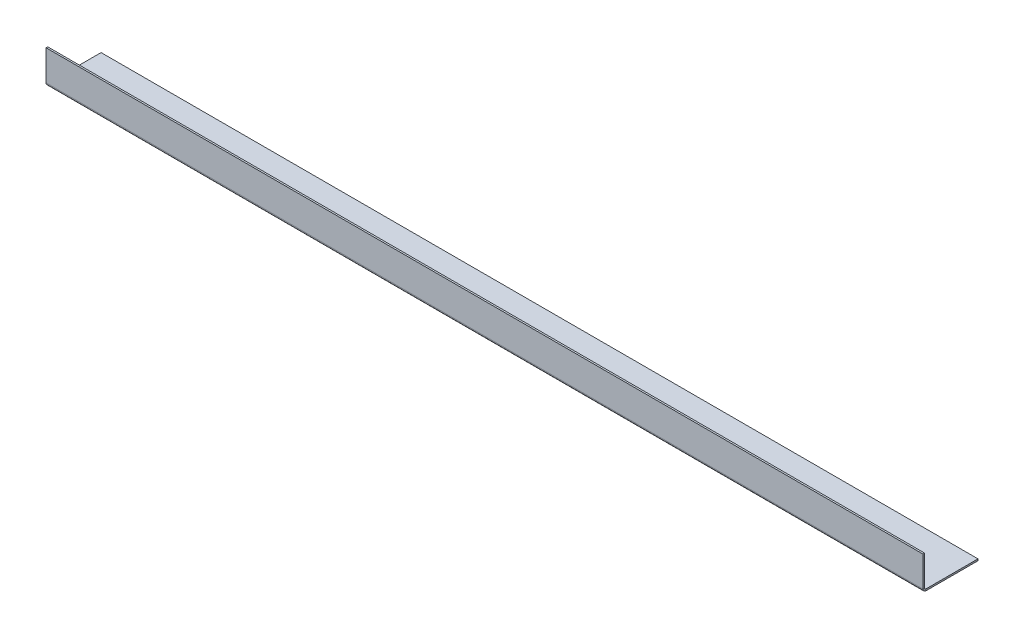
ISO-10303-21;
HEADER;
FILE_DESCRIPTION(('STEP AP214'),'2;1');
FILE_NAME('part.step','',(''),(''),'','','');
FILE_SCHEMA(('AUTOMOTIVE_DESIGN { 1 0 10303 214 1 1 1 1 }'));
ENDSEC;
DATA;
#1=APPLICATION_CONTEXT('core data for automotive mechanical design processes');
#2=APPLICATION_PROTOCOL_DEFINITION('international standard','automotive_design',2000,#1);
#3=PRODUCT_CONTEXT('',#1,'mechanical');
#4=PRODUCT('Part','Part','',(#3));
#5=PRODUCT_RELATED_PRODUCT_CATEGORY('part','',(#4));
#6=PRODUCT_DEFINITION_FORMATION('','',#4);
#7=PRODUCT_DEFINITION_CONTEXT('part definition',#1,'design');
#8=PRODUCT_DEFINITION('design','',#6,#7);
#9=PRODUCT_DEFINITION_SHAPE('','',#8);
#10=(LENGTH_UNIT() NAMED_UNIT(*) SI_UNIT(.MILLI.,.METRE.));
#11=(NAMED_UNIT(*) PLANE_ANGLE_UNIT() SI_UNIT($,.RADIAN.));
#12=(NAMED_UNIT(*) SI_UNIT($,.STERADIAN.) SOLID_ANGLE_UNIT());
#13=UNCERTAINTY_MEASURE_WITH_UNIT(LENGTH_MEASURE(1.E-05),#10,'distance_accuracy_value','');
#14=(GEOMETRIC_REPRESENTATION_CONTEXT(3) GLOBAL_UNCERTAINTY_ASSIGNED_CONTEXT((#13)) GLOBAL_UNIT_ASSIGNED_CONTEXT((#10,
#11,#12)) REPRESENTATION_CONTEXT('',''));
#15=CARTESIAN_POINT('',(0.,0.,0.));
#16=DIRECTION('',(0.,0.,1.));
#17=DIRECTION('',(1.,0.,0.));
#18=AXIS2_PLACEMENT_3D('',#15,#16,#17);
#19=CARTESIAN_POINT('',(0.,3.,93.5));
#20=DIRECTION('',(0.,-1.,0.));
#21=DIRECTION('',(1.,0.,0.));
#22=AXIS2_PLACEMENT_3D('',#19,#20,#21);
#23=PLANE('',#22);
#24=DIRECTION('',(-1.,0.,0.));
#25=VECTOR('',#24,1.);
#26=CARTESIAN_POINT('',(0.,3.,0.));
#27=LINE('',#26,#25);
#28=CARTESIAN_POINT('',(0.,3.,0.));
#29=VERTEX_POINT('',#28);
#30=CARTESIAN_POINT('',(-1576.,2.99999999999981,0.));
#31=VERTEX_POINT('',#30);
#32=EDGE_CURVE('E116',#29,#31,#27,.T.);
#33=ORIENTED_EDGE('',*,*,#32,.T.);
#34=DIRECTION('',(0.,0.,-1.));
#35=VECTOR('',#34,1.);
#36=CARTESIAN_POINT('',(-1576.,2.99999999999981,93.5));
#37=LINE('',#36,#35);
#38=CARTESIAN_POINT('',(-1576.,2.99999999999989,93.5));
#39=VERTEX_POINT('',#38);
#40=EDGE_CURVE('E13',#39,#31,#37,.T.);
#41=ORIENTED_EDGE('',*,*,#40,.F.);
#42=DIRECTION('',(-1.,0.,0.));
#43=VECTOR('',#42,1.);
#44=CARTESIAN_POINT('',(0.,3.,93.5));
#45=LINE('',#44,#43);
#46=CARTESIAN_POINT('',(0.,2.99999999999989,93.5));
#47=VERTEX_POINT('',#46);
#48=EDGE_CURVE('E117',#47,#39,#45,.T.);
#49=ORIENTED_EDGE('',*,*,#48,.F.);
#50=DIRECTION('',(0.,0.,-1.));
#51=VECTOR('',#50,1.);
#52=CARTESIAN_POINT('',(0.,3.,93.5));
#53=LINE('',#52,#51);
#54=EDGE_CURVE('E102',#47,#29,#53,.T.);
#55=ORIENTED_EDGE('',*,*,#54,.T.);
#56=EDGE_LOOP('',(#33,#41,#49,#55));
#57=FACE_BOUND('',#56,.T.);
#58=ADVANCED_FACE('F59',(#57),#23,.F.);
#59=CARTESIAN_POINT('',(-1576.,-1.93004335545623E-13,93.5));
#60=DIRECTION('',(-1.,0.,0.));
#61=DIRECTION('',(0.,0.,1.));
#62=AXIS2_PLACEMENT_3D('',#59,#60,#61);
#63=PLANE('',#62);
#64=DIRECTION('',(0.,1.,0.));
#65=VECTOR('',#64,1.);
#66=CARTESIAN_POINT('',(-1576.,-1.93004335545623E-13,0.));
#67=LINE('',#66,#65);
#68=CARTESIAN_POINT('',(-1576.,-1.93004335545623E-13,0.));
#69=VERTEX_POINT('',#68);
#70=EDGE_CURVE('E111',#69,#31,#67,.T.);
#71=ORIENTED_EDGE('',*,*,#70,.F.);
#72=DIRECTION('',(0.,0.,-1.));
#73=VECTOR('',#72,1.);
#74=CARTESIAN_POINT('',(-1576.,-1.93004335545623E-13,93.5));
#75=LINE('',#74,#73);
#76=CARTESIAN_POINT('',(-1576.,-1.93004335545623E-13,93.5));
#77=VERTEX_POINT('',#76);
#78=EDGE_CURVE('E67',#77,#69,#75,.T.);
#79=ORIENTED_EDGE('',*,*,#78,.F.);
#80=DIRECTION('',(0.,1.,0.));
#81=VECTOR('',#80,1.);
#82=CARTESIAN_POINT('',(-1576.,-1.93004335545623E-13,93.5));
#83=LINE('',#82,#81);
#84=EDGE_CURVE('E120',#77,#39,#83,.T.);
#85=ORIENTED_EDGE('',*,*,#84,.T.);
#86=ORIENTED_EDGE('',*,*,#40,.T.);
#87=EDGE_LOOP('',(#71,#79,#85,#86));
#88=FACE_BOUND('',#87,.T.);
#89=ADVANCED_FACE('F132',(#88),#63,.T.);
#90=CARTESIAN_POINT('',(0.,0.,93.5));
#91=DIRECTION('',(0.,-1.,0.));
#92=DIRECTION('',(1.,0.,0.));
#93=AXIS2_PLACEMENT_3D('',#90,#91,#92);
#94=PLANE('',#93);
#95=DIRECTION('',(-1.,0.,0.));
#96=VECTOR('',#95,1.);
#97=CARTESIAN_POINT('',(0.,0.,0.));
#98=LINE('',#97,#96);
#99=CARTESIAN_POINT('',(0.,0.,0.));
#100=VERTEX_POINT('',#99);
#101=EDGE_CURVE('E105',#100,#69,#98,.T.);
#102=ORIENTED_EDGE('',*,*,#101,.F.);
#103=DIRECTION('',(0.,0.,-1.));
#104=VECTOR('',#103,1.);
#105=CARTESIAN_POINT('',(0.,0.,93.5));
#106=LINE('',#105,#104);
#107=CARTESIAN_POINT('',(0.,-1.0842021724855E-13,93.5));
#108=VERTEX_POINT('',#107);
#109=EDGE_CURVE('E92',#108,#100,#106,.T.);
#110=ORIENTED_EDGE('',*,*,#109,.F.);
#111=DIRECTION('',(-1.,0.,0.));
#112=VECTOR('',#111,1.);
#113=CARTESIAN_POINT('',(0.,0.,93.5));
#114=LINE('',#113,#112);
#115=EDGE_CURVE('E126',#108,#77,#114,.T.);
#116=ORIENTED_EDGE('',*,*,#115,.T.);
#117=ORIENTED_EDGE('',*,*,#78,.T.);
#118=EDGE_LOOP('',(#102,#110,#116,#117));
#119=FACE_BOUND('',#118,.T.);
#120=ADVANCED_FACE('F106',(#119),#94,.T.);
#121=CARTESIAN_POINT('',(0.,3.,93.5));
#122=DIRECTION('',(1.,0.,0.));
#123=DIRECTION('',(0.,1.,0.));
#124=AXIS2_PLACEMENT_3D('',#121,#122,#123);
#125=PLANE('',#124);
#126=DIRECTION('',(0.,-1.,0.));
#127=VECTOR('',#126,1.);
#128=CARTESIAN_POINT('',(0.,3.,0.));
#129=LINE('',#128,#127);
#130=EDGE_CURVE('E97',#29,#100,#129,.T.);
#131=ORIENTED_EDGE('',*,*,#130,.F.);
#132=ORIENTED_EDGE('',*,*,#54,.F.);
#133=DIRECTION('',(0.,-1.,0.));
#134=VECTOR('',#133,1.);
#135=CARTESIAN_POINT('',(0.,3.,93.5));
#136=LINE('',#135,#134);
#137=EDGE_CURVE('E99',#47,#108,#136,.T.);
#138=ORIENTED_EDGE('',*,*,#137,.T.);
#139=ORIENTED_EDGE('',*,*,#109,.T.);
#140=EDGE_LOOP('',(#131,#132,#138,#139));
#141=FACE_BOUND('',#140,.T.);
#142=ADVANCED_FACE('F94',(#141),#125,.T.);
#143=CARTESIAN_POINT('',(0.,0.,0.));
#144=DIRECTION('',(0.,0.,-1.));
#145=DIRECTION('',(-1.,0.,0.));
#146=AXIS2_PLACEMENT_3D('',#143,#144,#145);
#147=PLANE('',#146);
#148=ORIENTED_EDGE('',*,*,#32,.F.);
#149=ORIENTED_EDGE('',*,*,#130,.T.);
#150=ORIENTED_EDGE('',*,*,#101,.T.);
#151=ORIENTED_EDGE('',*,*,#70,.T.);
#152=EDGE_LOOP('',(#148,#149,#150,#151));
#153=FACE_BOUND('',#152,.T.);
#154=ADVANCED_FACE('F114',(#153),#147,.T.);
#155=CARTESIAN_POINT('',(-1576.,5.49999999999988,93.5));
#156=DIRECTION('',(-1.,0.,0.));
#157=DIRECTION('',(0.,0.,1.));
#158=AXIS2_PLACEMENT_3D('',#155,#156,#157);
#159=PLANE('',#158);
#160=DIRECTION('',(0.,0.,-1.));
#161=VECTOR('',#160,1.);
#162=CARTESIAN_POINT('',(-1576.,5.4999999999998,99.));
#163=LINE('',#162,#161);
#164=CARTESIAN_POINT('',(-1576.,5.49999999999988,96.));
#165=VERTEX_POINT('',#164);
#166=CARTESIAN_POINT('',(-1576.,5.49999999999988,99.));
#167=VERTEX_POINT('',#166);
#168=EDGE_CURVE('E227',#165,#167,#163,.F.);
#169=ORIENTED_EDGE('',*,*,#168,.F.);
#170=CARTESIAN_POINT('',(-1576.,5.49999999999988,93.5));
#171=DIRECTION('',(1.,0.,0.));
#172=DIRECTION('',(0.,0.,-1.));
#173=AXIS2_PLACEMENT_3D('',#170,#171,#172);
#174=CIRCLE('',#173,2.49999999999999);
#175=EDGE_CURVE('E234',#39,#165,#174,.F.);
#176=ORIENTED_EDGE('',*,*,#175,.F.);
#177=ORIENTED_EDGE('',*,*,#84,.F.);
#178=CARTESIAN_POINT('',(-1576.,5.49999999999988,93.5));
#179=DIRECTION('',(1.,0.,0.));
#180=DIRECTION('',(0.,0.,-1.));
#181=AXIS2_PLACEMENT_3D('',#178,#179,#180);
#182=CIRCLE('',#181,5.49999999999999);
#183=EDGE_CURVE('E74',#77,#167,#182,.F.);
#184=ORIENTED_EDGE('',*,*,#183,.T.);
#185=EDGE_LOOP('',(#169,#176,#177,#184));
#186=FACE_BOUND('',#185,.T.);
#187=ADVANCED_FACE('F149',(#186),#159,.T.);
#188=CARTESIAN_POINT('',(0.,5.49999999999988,93.5));
#189=DIRECTION('',(-1.,0.,0.));
#190=DIRECTION('',(0.,0.,1.));
#191=AXIS2_PLACEMENT_3D('',#188,#189,#190);
#192=PLANE('',#191);
#193=CARTESIAN_POINT('',(0.,5.49999999999988,93.5));
#194=DIRECTION('',(1.,0.,0.));
#195=DIRECTION('',(0.,0.,-1.));
#196=AXIS2_PLACEMENT_3D('',#193,#194,#195);
#197=CIRCLE('',#196,2.49999999999999);
#198=CARTESIAN_POINT('',(0.,5.49999999999988,96.));
#199=VERTEX_POINT('',#198);
#200=EDGE_CURVE('E237',#199,#47,#197,.T.);
#201=ORIENTED_EDGE('',*,*,#200,.F.);
#202=DIRECTION('',(0.,0.,-1.));
#203=VECTOR('',#202,1.);
#204=CARTESIAN_POINT('',(0.,5.49999999999996,96.));
#205=LINE('',#204,#203);
#206=CARTESIAN_POINT('',(0.,5.49999999999996,99.));
#207=VERTEX_POINT('',#206);
#208=EDGE_CURVE('E202',#199,#207,#205,.F.);
#209=ORIENTED_EDGE('',*,*,#208,.T.);
#210=CARTESIAN_POINT('',(0.,5.49999999999988,93.5));
#211=DIRECTION('',(1.,0.,0.));
#212=DIRECTION('',(0.,0.,-1.));
#213=AXIS2_PLACEMENT_3D('',#210,#211,#212);
#214=CIRCLE('',#213,5.49999999999999);
#215=EDGE_CURVE('E231',#207,#108,#214,.T.);
#216=ORIENTED_EDGE('',*,*,#215,.T.);
#217=ORIENTED_EDGE('',*,*,#137,.F.);
#218=EDGE_LOOP('',(#201,#209,#216,#217));
#219=FACE_BOUND('',#218,.T.);
#220=ADVANCED_FACE('F150',(#219),#192,.F.);
#221=CARTESIAN_POINT('',(0.,5.49999999999988,93.5));
#222=DIRECTION('',(1.,0.,0.));
#223=DIRECTION('',(0.,0.,1.));
#224=AXIS2_PLACEMENT_3D('',#221,#222,#223);
#225=CYLINDRICAL_SURFACE('',#224,5.49999999999999);
#226=ORIENTED_EDGE('',*,*,#115,.F.);
#227=ORIENTED_EDGE('',*,*,#215,.F.);
#228=DIRECTION('',(1.,0.,0.));
#229=VECTOR('',#228,1.);
#230=CARTESIAN_POINT('',(-1576.,5.4999999999998,99.));
#231=LINE('',#230,#229);
#232=EDGE_CURVE('E189',#207,#167,#231,.F.);
#233=ORIENTED_EDGE('',*,*,#232,.T.);
#234=ORIENTED_EDGE('',*,*,#183,.F.);
#235=EDGE_LOOP('',(#226,#227,#233,#234));
#236=FACE_BOUND('',#235,.T.);
#237=ADVANCED_FACE('F153',(#236),#225,.T.);
#238=CARTESIAN_POINT('',(0.,5.49999999999988,93.5));
#239=DIRECTION('',(1.,0.,0.));
#240=DIRECTION('',(0.,0.,1.));
#241=AXIS2_PLACEMENT_3D('',#238,#239,#240);
#242=CYLINDRICAL_SURFACE('',#241,2.49999999999999);
#243=ORIENTED_EDGE('',*,*,#48,.T.);
#244=ORIENTED_EDGE('',*,*,#175,.T.);
#245=DIRECTION('',(1.,0.,0.));
#246=VECTOR('',#245,1.);
#247=CARTESIAN_POINT('',(-1576.,5.4999999999998,96.));
#248=LINE('',#247,#246);
#249=EDGE_CURVE('E224',#165,#199,#248,.T.);
#250=ORIENTED_EDGE('',*,*,#249,.T.);
#251=ORIENTED_EDGE('',*,*,#200,.T.);
#252=EDGE_LOOP('',(#243,#244,#250,#251));
#253=FACE_BOUND('',#252,.T.);
#254=ADVANCED_FACE('F158',(#253),#242,.F.);
#255=CARTESIAN_POINT('',(0.,60.,99.));
#256=DIRECTION('',(-1.,0.,0.));
#257=DIRECTION('',(0.,-1.,0.));
#258=AXIS2_PLACEMENT_3D('',#255,#256,#257);
#259=PLANE('',#258);
#260=ORIENTED_EDGE('',*,*,#208,.F.);
#261=DIRECTION('',(0.,-1.,0.));
#262=VECTOR('',#261,1.);
#263=CARTESIAN_POINT('',(0.,60.,96.));
#264=LINE('',#263,#262);
#265=CARTESIAN_POINT('',(0.,60.,96.));
#266=VERTEX_POINT('',#265);
#267=EDGE_CURVE('E201',#199,#266,#264,.F.);
#268=ORIENTED_EDGE('',*,*,#267,.T.);
#269=DIRECTION('',(0.,0.,-1.));
#270=VECTOR('',#269,1.);
#271=CARTESIAN_POINT('',(0.,60.,99.));
#272=LINE('',#271,#270);
#273=CARTESIAN_POINT('',(0.,60.,99.));
#274=VERTEX_POINT('',#273);
#275=EDGE_CURVE('E209',#274,#266,#272,.T.);
#276=ORIENTED_EDGE('',*,*,#275,.F.);
#277=DIRECTION('',(0.,1.,0.));
#278=VECTOR('',#277,1.);
#279=CARTESIAN_POINT('',(0.,0.,99.));
#280=LINE('',#279,#278);
#281=EDGE_CURVE('E193',#207,#274,#280,.T.);
#282=ORIENTED_EDGE('',*,*,#281,.F.);
#283=EDGE_LOOP('',(#260,#268,#276,#282));
#284=FACE_BOUND('',#283,.T.);
#285=ADVANCED_FACE('F161',(#284),#259,.F.);
#286=CARTESIAN_POINT('',(-1576.,2.99999999999981,99.));
#287=DIRECTION('',(1.,0.,0.));
#288=DIRECTION('',(0.,0.,-1.));
#289=AXIS2_PLACEMENT_3D('',#286,#287,#288);
#290=PLANE('',#289);
#291=ORIENTED_EDGE('',*,*,#168,.T.);
#292=DIRECTION('',(0.,-1.,0.));
#293=VECTOR('',#292,1.);
#294=CARTESIAN_POINT('',(-1576.,0.,99.));
#295=LINE('',#294,#293);
#296=CARTESIAN_POINT('',(-1576.,60.,99.));
#297=VERTEX_POINT('',#296);
#298=EDGE_CURVE('E197',#297,#167,#295,.T.);
#299=ORIENTED_EDGE('',*,*,#298,.F.);
#300=DIRECTION('',(0.,0.,-1.));
#301=VECTOR('',#300,1.);
#302=CARTESIAN_POINT('',(-1576.,60.,99.));
#303=LINE('',#302,#301);
#304=CARTESIAN_POINT('',(-1576.,60.,96.));
#305=VERTEX_POINT('',#304);
#306=EDGE_CURVE('E241',#297,#305,#303,.T.);
#307=ORIENTED_EDGE('',*,*,#306,.T.);
#308=DIRECTION('',(0.,1.,0.));
#309=VECTOR('',#308,1.);
#310=CARTESIAN_POINT('',(-1576.,2.99999999999981,96.));
#311=LINE('',#310,#309);
#312=EDGE_CURVE('E212',#305,#165,#311,.F.);
#313=ORIENTED_EDGE('',*,*,#312,.T.);
#314=EDGE_LOOP('',(#291,#299,#307,#313));
#315=FACE_BOUND('',#314,.T.);
#316=ADVANCED_FACE('F167',(#315),#290,.F.);
#317=CARTESIAN_POINT('',(0.,0.,99.));
#318=DIRECTION('',(0.,0.,-1.));
#319=DIRECTION('',(-1.,0.,0.));
#320=AXIS2_PLACEMENT_3D('',#317,#318,#319);
#321=PLANE('',#320);
#322=ORIENTED_EDGE('',*,*,#232,.F.);
#323=ORIENTED_EDGE('',*,*,#281,.T.);
#324=DIRECTION('',(-1.,0.,0.));
#325=VECTOR('',#324,1.);
#326=CARTESIAN_POINT('',(0.,60.,99.));
#327=LINE('',#326,#325);
#328=EDGE_CURVE('E211',#274,#297,#327,.T.);
#329=ORIENTED_EDGE('',*,*,#328,.T.);
#330=ORIENTED_EDGE('',*,*,#298,.T.);
#331=EDGE_LOOP('',(#322,#323,#329,#330));
#332=FACE_BOUND('',#331,.T.);
#333=ADVANCED_FACE('F176',(#332),#321,.F.);
#334=CARTESIAN_POINT('',(0.,0.,96.));
#335=DIRECTION('',(0.,0.,-1.));
#336=DIRECTION('',(-1.,0.,0.));
#337=AXIS2_PLACEMENT_3D('',#334,#335,#336);
#338=PLANE('',#337);
#339=ORIENTED_EDGE('',*,*,#267,.F.);
#340=ORIENTED_EDGE('',*,*,#249,.F.);
#341=ORIENTED_EDGE('',*,*,#312,.F.);
#342=DIRECTION('',(1.,0.,0.));
#343=VECTOR('',#342,1.);
#344=CARTESIAN_POINT('',(-1576.,60.,96.));
#345=LINE('',#344,#343);
#346=EDGE_CURVE('E216',#266,#305,#345,.F.);
#347=ORIENTED_EDGE('',*,*,#346,.F.);
#348=EDGE_LOOP('',(#339,#340,#341,#347));
#349=FACE_BOUND('',#348,.T.);
#350=ADVANCED_FACE('F172',(#349),#338,.T.);
#351=CARTESIAN_POINT('',(-1576.,60.,99.));
#352=DIRECTION('',(0.,-1.,0.));
#353=DIRECTION('',(0.,0.,-1.));
#354=AXIS2_PLACEMENT_3D('',#351,#352,#353);
#355=PLANE('',#354);
#356=ORIENTED_EDGE('',*,*,#346,.T.);
#357=ORIENTED_EDGE('',*,*,#306,.F.);
#358=ORIENTED_EDGE('',*,*,#328,.F.);
#359=ORIENTED_EDGE('',*,*,#275,.T.);
#360=EDGE_LOOP('',(#356,#357,#358,#359));
#361=FACE_BOUND('',#360,.T.);
#362=ADVANCED_FACE('F169',(#361),#355,.F.);
#363=CLOSED_SHELL('',(#58,#89,#120,#142,#154,#187,#220,#237,#254,#285,#316,#333,#350,#362));
#364=MANIFOLD_SOLID_BREP('B2',#363);
#365=ADVANCED_BREP_SHAPE_REPRESENTATION('',(#18,#364),#14);
#366=SHAPE_DEFINITION_REPRESENTATION(#9,#365);
ENDSEC;
END-ISO-10303-21;
